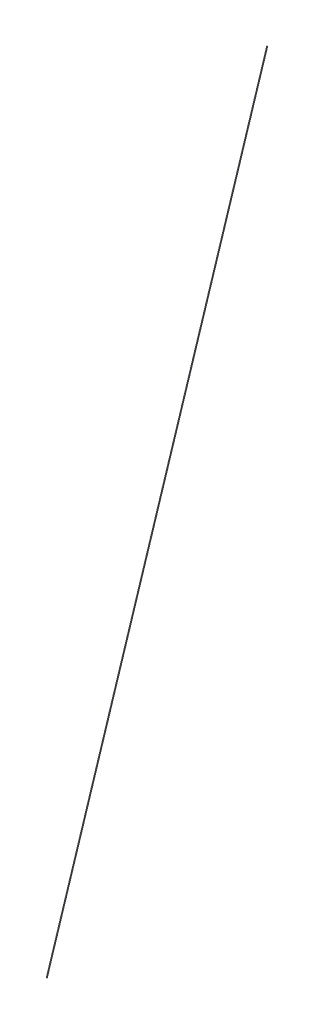
ISO-10303-21;
HEADER;
FILE_DESCRIPTION(('STEP AP214'),'2;1');
FILE_NAME('part.step','',(''),(''),'','','');
FILE_SCHEMA(('AUTOMOTIVE_DESIGN { 1 0 10303 214 1 1 1 1 }'));
ENDSEC;
DATA;
#1=APPLICATION_CONTEXT('core data for automotive mechanical design processes');
#2=APPLICATION_PROTOCOL_DEFINITION('international standard','automotive_design',2000,#1);
#3=PRODUCT_CONTEXT('',#1,'mechanical');
#4=PRODUCT('Part','Part','',(#3));
#5=PRODUCT_RELATED_PRODUCT_CATEGORY('part','',(#4));
#6=PRODUCT_DEFINITION_FORMATION('','',#4);
#7=PRODUCT_DEFINITION_CONTEXT('part definition',#1,'design');
#8=PRODUCT_DEFINITION('design','',#6,#7);
#9=PRODUCT_DEFINITION_SHAPE('','',#8);
#10=(LENGTH_UNIT() NAMED_UNIT(*) SI_UNIT(.MILLI.,.METRE.));
#11=(NAMED_UNIT(*) PLANE_ANGLE_UNIT() SI_UNIT($,.RADIAN.));
#12=(NAMED_UNIT(*) SI_UNIT($,.STERADIAN.) SOLID_ANGLE_UNIT());
#13=UNCERTAINTY_MEASURE_WITH_UNIT(LENGTH_MEASURE(1.E-05),#10,'distance_accuracy_value','');
#14=(GEOMETRIC_REPRESENTATION_CONTEXT(3) GLOBAL_UNCERTAINTY_ASSIGNED_CONTEXT((#13)) GLOBAL_UNIT_ASSIGNED_CONTEXT((#10,
#11,#12)) REPRESENTATION_CONTEXT('',''));
#15=CARTESIAN_POINT('',(0.,0.,0.));
#16=DIRECTION('',(0.,0.,1.));
#17=DIRECTION('',(1.,0.,0.));
#18=AXIS2_PLACEMENT_3D('',#15,#16,#17);
#19=CARTESIAN_POINT('',(0.,0.,0.));
#20=DIRECTION('',(0.233695444699784,0.972309847284584,0.));
#21=DIRECTION('',(-0.972309847284584,0.233695444699784,0.));
#22=AXIS2_PLACEMENT_3D('',#19,#20,#21);
#23=PLANE('',#22);
#24=CARTESIAN_POINT('',(0.,0.,0.));
#25=DIRECTION('',(0.233695444699784,0.972309847284584,0.));
#26=DIRECTION('',(-0.972309847284584,0.233695444699784,0.));
#27=AXIS2_PLACEMENT_3D('',#24,#25,#26);
#28=CIRCLE('',#27,0.5);
#29=CARTESIAN_POINT('',(-0.486154923642292,0.116847722349892,0.));
#30=VERTEX_POINT('',#29);
#31=EDGE_CURVE('E50',#30,#30,#28,.T.);
#32=ORIENTED_EDGE('',*,*,#31,.F.);
#33=EDGE_LOOP('',(#32));
#34=FACE_BOUND('',#33,.T.);
#35=ADVANCED_FACE('F43',(#34),#23,.F.);
#36=CARTESIAN_POINT('',(307.5,1279.38,0.));
#37=DIRECTION('',(0.233695444699784,0.972309847284584,0.));
#38=DIRECTION('',(-0.972309847284584,0.233695444699784,0.));
#39=AXIS2_PLACEMENT_3D('',#36,#37,#38);
#40=PLANE('',#39);
#41=CARTESIAN_POINT('',(307.5,1279.38,0.));
#42=DIRECTION('',(0.233695444699784,0.972309847284584,0.));
#43=DIRECTION('',(-0.972309847284584,0.233695444699784,0.));
#44=AXIS2_PLACEMENT_3D('',#41,#42,#43);
#45=CIRCLE('',#44,0.5);
#46=CARTESIAN_POINT('',(307.013845076358,1279.49684772235,0.));
#47=VERTEX_POINT('',#46);
#48=EDGE_CURVE('E11',#47,#47,#45,.T.);
#49=ORIENTED_EDGE('',*,*,#48,.T.);
#50=EDGE_LOOP('',(#49));
#51=FACE_BOUND('',#50,.T.);
#52=ADVANCED_FACE('F60',(#51),#40,.T.);
#53=CARTESIAN_POINT('',(0.,0.,0.));
#54=DIRECTION('',(0.233695444699784,0.972309847284584,0.));
#55=DIRECTION('',(-0.972309847284584,0.233695444699784,0.));
#56=AXIS2_PLACEMENT_3D('',#53,#54,#55);
#57=CYLINDRICAL_SURFACE('',#56,0.5);
#58=ORIENTED_EDGE('',*,*,#48,.F.);
#59=EDGE_LOOP('',(#58));
#60=FACE_BOUND('',#59,.T.);
#61=ORIENTED_EDGE('',*,*,#31,.T.);
#62=EDGE_LOOP('',(#61));
#63=FACE_BOUND('',#62,.T.);
#64=ADVANCED_FACE('F57',(#60,#63),#57,.T.);
#65=CLOSED_SHELL('',(#35,#52,#64));
#66=MANIFOLD_SOLID_BREP('B2',#65);
#67=ADVANCED_BREP_SHAPE_REPRESENTATION('',(#18,#66),#14);
#68=SHAPE_DEFINITION_REPRESENTATION(#9,#67);
ENDSEC;
END-ISO-10303-21;
